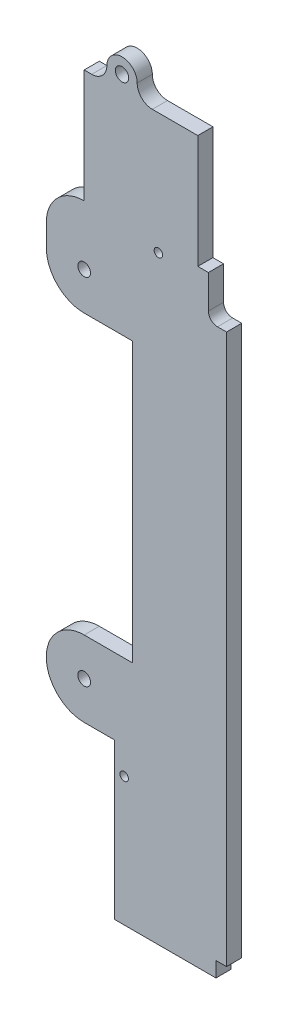
ISO-10303-21;
HEADER;
FILE_DESCRIPTION(('STEP AP214'),'2;1');
FILE_NAME('part.step','',(''),(''),'','','');
FILE_SCHEMA(('AUTOMOTIVE_DESIGN { 1 0 10303 214 1 1 1 1 }'));
ENDSEC;
DATA;
#1=APPLICATION_CONTEXT('core data for automotive mechanical design processes');
#2=APPLICATION_PROTOCOL_DEFINITION('international standard','automotive_design',2000,#1);
#3=PRODUCT_CONTEXT('',#1,'mechanical');
#4=PRODUCT('Part','Part','',(#3));
#5=PRODUCT_RELATED_PRODUCT_CATEGORY('part','',(#4));
#6=PRODUCT_DEFINITION_FORMATION('','',#4);
#7=PRODUCT_DEFINITION_CONTEXT('part definition',#1,'design');
#8=PRODUCT_DEFINITION('design','',#6,#7);
#9=PRODUCT_DEFINITION_SHAPE('','',#8);
#10=(LENGTH_UNIT() NAMED_UNIT(*) SI_UNIT(.MILLI.,.METRE.));
#11=(NAMED_UNIT(*) PLANE_ANGLE_UNIT() SI_UNIT($,.RADIAN.));
#12=(NAMED_UNIT(*) SI_UNIT($,.STERADIAN.) SOLID_ANGLE_UNIT());
#13=UNCERTAINTY_MEASURE_WITH_UNIT(LENGTH_MEASURE(1.E-05),#10,'distance_accuracy_value','');
#14=(GEOMETRIC_REPRESENTATION_CONTEXT(3) GLOBAL_UNCERTAINTY_ASSIGNED_CONTEXT((#13)) GLOBAL_UNIT_ASSIGNED_CONTEXT((#10,
#11,#12)) REPRESENTATION_CONTEXT('',''));
#15=CARTESIAN_POINT('',(0.,0.,0.));
#16=DIRECTION('',(0.,0.,1.));
#17=DIRECTION('',(1.,0.,0.));
#18=AXIS2_PLACEMENT_3D('',#15,#16,#17);
#19=CARTESIAN_POINT('',(44.,125.6,5.));
#20=DIRECTION('',(0.,0.,1.));
#21=DIRECTION('',(1.,0.,0.));
#22=AXIS2_PLACEMENT_3D('',#19,#20,#21);
#23=PLANE('',#22);
#24=CARTESIAN_POINT('',(24.5,134.,5.));
#25=DIRECTION('',(0.,0.,1.));
#26=DIRECTION('',(1.,0.,0.));
#27=AXIS2_PLACEMENT_3D('',#24,#25,#26);
#28=CIRCLE('',#27,1.40000000000001);
#29=CARTESIAN_POINT('',(25.9,134.,5.));
#30=VERTEX_POINT('',#29);
#31=EDGE_CURVE('E452',#30,#30,#28,.T.);
#32=ORIENTED_EDGE('',*,*,#31,.F.);
#33=EDGE_LOOP('',(#32));
#34=FACE_BOUND('',#33,.T.);
#35=CARTESIAN_POINT('',(13.2,-21.3,5.));
#36=DIRECTION('',(0.,0.,1.));
#37=DIRECTION('',(1.,0.,0.));
#38=AXIS2_PLACEMENT_3D('',#35,#36,#37);
#39=CIRCLE('',#38,1.4);
#40=CARTESIAN_POINT('',(14.6,-21.3,5.));
#41=VERTEX_POINT('',#40);
#42=EDGE_CURVE('E425',#41,#41,#39,.T.);
#43=ORIENTED_EDGE('',*,*,#42,.F.);
#44=EDGE_LOOP('',(#43));
#45=FACE_BOUND('',#44,.T.);
#46=CARTESIAN_POINT('',(0.,117.,5.));
#47=DIRECTION('',(0.,0.,1.));
#48=DIRECTION('',(1.,0.,0.));
#49=AXIS2_PLACEMENT_3D('',#46,#47,#48);
#50=CIRCLE('',#49,2.1);
#51=CARTESIAN_POINT('',(2.1,117.,5.));
#52=VERTEX_POINT('',#51);
#53=EDGE_CURVE('E438',#52,#52,#50,.T.);
#54=ORIENTED_EDGE('',*,*,#53,.F.);
#55=EDGE_LOOP('',(#54));
#56=FACE_BOUND('',#55,.T.);
#57=DIRECTION('',(1.,0.,0.));
#58=VECTOR('',#57,1.);
#59=CARTESIAN_POINT('',(43.5,-58.8,5.));
#60=LINE('',#59,#58);
#61=CARTESIAN_POINT('',(43.5,-58.8,5.));
#62=VERTEX_POINT('',#61);
#63=CARTESIAN_POINT('',(47.,-58.8,5.));
#64=VERTEX_POINT('',#63);
#65=EDGE_CURVE('E297',#62,#64,#60,.T.);
#66=ORIENTED_EDGE('',*,*,#65,.T.);
#67=DIRECTION('',(0.,1.,0.));
#68=VECTOR('',#67,1.);
#69=CARTESIAN_POINT('',(47.,-29.8,5.));
#70=LINE('',#69,#68);
#71=CARTESIAN_POINT('',(47.,122.6,5.));
#72=VERTEX_POINT('',#71);
#73=EDGE_CURVE('E154',#64,#72,#70,.T.);
#74=ORIENTED_EDGE('',*,*,#73,.T.);
#75=DIRECTION('',(-1.,0.,0.));
#76=VECTOR('',#75,1.);
#77=CARTESIAN_POINT('',(44.,122.6,5.));
#78=LINE('',#77,#76);
#79=CARTESIAN_POINT('',(44.,122.6,5.));
#80=VERTEX_POINT('',#79);
#81=EDGE_CURVE('E364',#72,#80,#78,.T.);
#82=ORIENTED_EDGE('',*,*,#81,.T.);
#83=CARTESIAN_POINT('',(44.,125.6,5.));
#84=DIRECTION('',(0.,0.,-1.));
#85=DIRECTION('',(1.,0.,0.));
#86=AXIS2_PLACEMENT_3D('',#83,#84,#85);
#87=CIRCLE('',#86,3.);
#88=CARTESIAN_POINT('',(41.,125.6,5.));
#89=VERTEX_POINT('',#88);
#90=EDGE_CURVE('E383',#80,#89,#87,.T.);
#91=ORIENTED_EDGE('',*,*,#90,.T.);
#92=DIRECTION('',(0.,1.,0.));
#93=VECTOR('',#92,1.);
#94=CARTESIAN_POINT('',(41.,136.6,5.));
#95=LINE('',#94,#93);
#96=CARTESIAN_POINT('',(41.,136.6,5.));
#97=VERTEX_POINT('',#96);
#98=EDGE_CURVE('E380',#89,#97,#95,.T.);
#99=ORIENTED_EDGE('',*,*,#98,.T.);
#100=DIRECTION('',(-1.,0.,0.));
#101=VECTOR('',#100,1.);
#102=CARTESIAN_POINT('',(41.,136.6,5.));
#103=LINE('',#102,#101);
#104=CARTESIAN_POINT('',(37.5,136.6,5.));
#105=VERTEX_POINT('',#104);
#106=EDGE_CURVE('E382',#97,#105,#103,.T.);
#107=ORIENTED_EDGE('',*,*,#106,.T.);
#108=DIRECTION('',(0.,1.,0.));
#109=VECTOR('',#108,1.);
#110=CARTESIAN_POINT('',(37.5,136.6,5.));
#111=LINE('',#110,#109);
#112=CARTESIAN_POINT('',(37.5,174.,5.));
#113=VERTEX_POINT('',#112);
#114=EDGE_CURVE('E385',#105,#113,#111,.T.);
#115=ORIENTED_EDGE('',*,*,#114,.T.);
#116=DIRECTION('',(-1.,0.,0.));
#117=VECTOR('',#116,1.);
#118=CARTESIAN_POINT('',(22.5,174.,5.));
#119=LINE('',#118,#117);
#120=CARTESIAN_POINT('',(22.5,174.,5.));
#121=VERTEX_POINT('',#120);
#122=EDGE_CURVE('E391',#113,#121,#119,.T.);
#123=ORIENTED_EDGE('',*,*,#122,.T.);
#124=CARTESIAN_POINT('',(22.5,179.,5.));
#125=DIRECTION('',(0.,0.,-1.));
#126=DIRECTION('',(1.,0.,0.));
#127=AXIS2_PLACEMENT_3D('',#124,#125,#126);
#128=CIRCLE('',#127,4.99999999999998);
#129=CARTESIAN_POINT('',(17.5,179.,5.));
#130=VERTEX_POINT('',#129);
#131=EDGE_CURVE('E393',#121,#130,#128,.T.);
#132=ORIENTED_EDGE('',*,*,#131,.T.);
#133=CARTESIAN_POINT('',(12.5,179.,5.));
#134=DIRECTION('',(0.,0.,1.));
#135=DIRECTION('',(1.,0.,0.));
#136=AXIS2_PLACEMENT_3D('',#133,#134,#135);
#137=CIRCLE('',#136,5.00000000000003);
#138=CARTESIAN_POINT('',(7.49999999999994,179.,5.));
#139=VERTEX_POINT('',#138);
#140=EDGE_CURVE('E395',#130,#139,#137,.T.);
#141=ORIENTED_EDGE('',*,*,#140,.T.);
#142=CARTESIAN_POINT('',(2.49999999999997,179.,5.));
#143=DIRECTION('',(0.,0.,-1.));
#144=DIRECTION('',(1.,0.,0.));
#145=AXIS2_PLACEMENT_3D('',#142,#143,#144);
#146=CIRCLE('',#145,4.99999999999999);
#147=CARTESIAN_POINT('',(2.49999999999997,174.,5.));
#148=VERTEX_POINT('',#147);
#149=EDGE_CURVE('E397',#139,#148,#146,.T.);
#150=ORIENTED_EDGE('',*,*,#149,.T.);
#151=DIRECTION('',(-1.,0.,0.));
#152=VECTOR('',#151,1.);
#153=CARTESIAN_POINT('',(0.,174.,5.));
#154=LINE('',#153,#152);
#155=CARTESIAN_POINT('',(0.,174.,5.));
#156=VERTEX_POINT('',#155);
#157=EDGE_CURVE('E399',#148,#156,#154,.T.);
#158=ORIENTED_EDGE('',*,*,#157,.T.);
#159=DIRECTION('',(0.,-1.,0.));
#160=VECTOR('',#159,1.);
#161=CARTESIAN_POINT('',(0.,136.6,5.));
#162=LINE('',#161,#160);
#163=CARTESIAN_POINT('',(0.,136.6,5.));
#164=VERTEX_POINT('',#163);
#165=EDGE_CURVE('E401',#156,#164,#162,.T.);
#166=ORIENTED_EDGE('',*,*,#165,.T.);
#167=CARTESIAN_POINT('',(0.,124.1,5.));
#168=DIRECTION('',(0.,0.,1.));
#169=DIRECTION('',(1.,0.,0.));
#170=AXIS2_PLACEMENT_3D('',#167,#168,#169);
#171=CIRCLE('',#170,12.5);
#172=CARTESIAN_POINT('',(-12.5,124.1,5.));
#173=VERTEX_POINT('',#172);
#174=EDGE_CURVE('E403',#164,#173,#171,.T.);
#175=ORIENTED_EDGE('',*,*,#174,.T.);
#176=DIRECTION('',(0.,-1.,0.));
#177=VECTOR('',#176,1.);
#178=CARTESIAN_POINT('',(-12.5,124.1,5.));
#179=LINE('',#178,#177);
#180=CARTESIAN_POINT('',(-12.5,117.,5.));
#181=VERTEX_POINT('',#180);
#182=EDGE_CURVE('E405',#173,#181,#179,.T.);
#183=ORIENTED_EDGE('',*,*,#182,.T.);
#184=CARTESIAN_POINT('',(0.,117.,5.));
#185=DIRECTION('',(0.,0.,1.));
#186=DIRECTION('',(1.,0.,0.));
#187=AXIS2_PLACEMENT_3D('',#184,#185,#186);
#188=CIRCLE('',#187,12.5);
#189=CARTESIAN_POINT('',(0.,104.5,5.));
#190=VERTEX_POINT('',#189);
#191=EDGE_CURVE('E407',#181,#190,#188,.T.);
#192=ORIENTED_EDGE('',*,*,#191,.T.);
#193=DIRECTION('',(1.,0.,0.));
#194=VECTOR('',#193,1.);
#195=CARTESIAN_POINT('',(16.,104.5,5.));
#196=LINE('',#195,#194);
#197=CARTESIAN_POINT('',(16.,104.5,5.));
#198=VERTEX_POINT('',#197);
#199=EDGE_CURVE('E409',#190,#198,#196,.T.);
#200=ORIENTED_EDGE('',*,*,#199,.T.);
#201=DIRECTION('',(0.,-1.,0.));
#202=VECTOR('',#201,1.);
#203=CARTESIAN_POINT('',(16.,12.5,5.));
#204=LINE('',#203,#202);
#205=CARTESIAN_POINT('',(16.,12.5,5.));
#206=VERTEX_POINT('',#205);
#207=EDGE_CURVE('E411',#198,#206,#204,.T.);
#208=ORIENTED_EDGE('',*,*,#207,.T.);
#209=DIRECTION('',(-1.,0.,0.));
#210=VECTOR('',#209,1.);
#211=CARTESIAN_POINT('',(0.,12.5,5.));
#212=LINE('',#211,#210);
#213=CARTESIAN_POINT('',(0.,12.5,5.));
#214=VERTEX_POINT('',#213);
#215=EDGE_CURVE('E414',#206,#214,#212,.T.);
#216=ORIENTED_EDGE('',*,*,#215,.T.);
#217=CARTESIAN_POINT('',(0.,0.,5.));
#218=DIRECTION('',(0.,0.,1.));
#219=DIRECTION('',(1.,0.,0.));
#220=AXIS2_PLACEMENT_3D('',#217,#218,#219);
#221=CIRCLE('',#220,12.5);
#222=CARTESIAN_POINT('',(0.,-12.5,5.));
#223=VERTEX_POINT('',#222);
#224=EDGE_CURVE('E417',#214,#223,#221,.T.);
#225=ORIENTED_EDGE('',*,*,#224,.T.);
#226=DIRECTION('',(1.,0.,0.));
#227=VECTOR('',#226,1.);
#228=CARTESIAN_POINT('',(0.,-12.5,5.));
#229=LINE('',#228,#227);
#230=CARTESIAN_POINT('',(10.,-12.5,5.));
#231=VERTEX_POINT('',#230);
#232=EDGE_CURVE('E225',#223,#231,#229,.T.);
#233=ORIENTED_EDGE('',*,*,#232,.T.);
#234=DIRECTION('',(0.,-1.,0.));
#235=VECTOR('',#234,1.);
#236=CARTESIAN_POINT('',(10.,-12.5,5.));
#237=LINE('',#236,#235);
#238=CARTESIAN_POINT('',(10.,-63.8,5.));
#239=VERTEX_POINT('',#238);
#240=EDGE_CURVE('E219',#231,#239,#237,.T.);
#241=ORIENTED_EDGE('',*,*,#240,.T.);
#242=DIRECTION('',(1.,0.,0.));
#243=VECTOR('',#242,1.);
#244=CARTESIAN_POINT('',(43.5,-63.8,5.));
#245=LINE('',#244,#243);
#246=CARTESIAN_POINT('',(43.5,-63.8,5.));
#247=VERTEX_POINT('',#246);
#248=EDGE_CURVE('E223',#239,#247,#245,.T.);
#249=ORIENTED_EDGE('',*,*,#248,.T.);
#250=DIRECTION('',(0.,1.,0.));
#251=VECTOR('',#250,1.);
#252=CARTESIAN_POINT('',(43.5,-58.8,5.));
#253=LINE('',#252,#251);
#254=EDGE_CURVE('E59',#247,#62,#253,.T.);
#255=ORIENTED_EDGE('',*,*,#254,.T.);
#256=EDGE_LOOP('',(#66,#74,#82,#91,#99,#107,#115,#123,#132,#141,#150,#158,#166,#175,#183,#192,
#200,#208,#216,#225,#233,#241,#249,#255));
#257=FACE_BOUND('',#256,.T.);
#258=CARTESIAN_POINT('',(0.,0.,5.));
#259=DIRECTION('',(0.,0.,1.));
#260=DIRECTION('',(1.,0.,0.));
#261=AXIS2_PLACEMENT_3D('',#258,#259,#260);
#262=CIRCLE('',#261,2.1);
#263=CARTESIAN_POINT('',(2.1,0.,5.));
#264=VERTEX_POINT('',#263);
#265=EDGE_CURVE('E247',#264,#264,#262,.T.);
#266=ORIENTED_EDGE('',*,*,#265,.F.);
#267=EDGE_LOOP('',(#266));
#268=FACE_BOUND('',#267,.T.);
#269=CARTESIAN_POINT('',(12.5,179.,5.));
#270=DIRECTION('',(0.,0.,1.));
#271=DIRECTION('',(1.,0.,0.));
#272=AXIS2_PLACEMENT_3D('',#269,#270,#271);
#273=CIRCLE('',#272,2.2);
#274=CARTESIAN_POINT('',(14.7,179.,5.));
#275=VERTEX_POINT('',#274);
#276=EDGE_CURVE('E445',#275,#275,#273,.T.);
#277=ORIENTED_EDGE('',*,*,#276,.F.);
#278=EDGE_LOOP('',(#277));
#279=FACE_BOUND('',#278,.T.);
#280=ADVANCED_FACE('F42',(#34,#45,#56,#257,#268,#279),#23,.T.);
#281=CARTESIAN_POINT('',(44.,125.6,0.));
#282=DIRECTION('',(0.,0.,1.));
#283=DIRECTION('',(1.,0.,0.));
#284=AXIS2_PLACEMENT_3D('',#281,#282,#283);
#285=PLANE('',#284);
#286=CARTESIAN_POINT('',(24.5,134.,0.));
#287=DIRECTION('',(0.,0.,1.));
#288=DIRECTION('',(1.,0.,0.));
#289=AXIS2_PLACEMENT_3D('',#286,#287,#288);
#290=CIRCLE('',#289,1.40000000000001);
#291=CARTESIAN_POINT('',(25.9,134.,0.));
#292=VERTEX_POINT('',#291);
#293=EDGE_CURVE('E429',#292,#292,#290,.T.);
#294=ORIENTED_EDGE('',*,*,#293,.T.);
#295=EDGE_LOOP('',(#294));
#296=FACE_BOUND('',#295,.T.);
#297=CARTESIAN_POINT('',(13.2,-21.3,0.));
#298=DIRECTION('',(0.,0.,1.));
#299=DIRECTION('',(1.,0.,0.));
#300=AXIS2_PLACEMENT_3D('',#297,#298,#299);
#301=CIRCLE('',#300,1.4);
#302=CARTESIAN_POINT('',(14.6,-21.3,0.));
#303=VERTEX_POINT('',#302);
#304=EDGE_CURVE('E421',#303,#303,#301,.T.);
#305=ORIENTED_EDGE('',*,*,#304,.T.);
#306=EDGE_LOOP('',(#305));
#307=FACE_BOUND('',#306,.T.);
#308=CARTESIAN_POINT('',(0.,117.,0.));
#309=DIRECTION('',(0.,0.,1.));
#310=DIRECTION('',(1.,0.,0.));
#311=AXIS2_PLACEMENT_3D('',#308,#309,#310);
#312=CIRCLE('',#311,2.1);
#313=CARTESIAN_POINT('',(2.1,117.,0.));
#314=VERTEX_POINT('',#313);
#315=EDGE_CURVE('E442',#314,#314,#312,.T.);
#316=ORIENTED_EDGE('',*,*,#315,.T.);
#317=EDGE_LOOP('',(#316));
#318=FACE_BOUND('',#317,.T.);
#319=DIRECTION('',(1.,0.,0.));
#320=VECTOR('',#319,1.);
#321=CARTESIAN_POINT('',(43.5,-58.8,0.));
#322=LINE('',#321,#320);
#323=CARTESIAN_POINT('',(43.5,-58.8,0.));
#324=VERTEX_POINT('',#323);
#325=CARTESIAN_POINT('',(47.,-58.8,0.));
#326=VERTEX_POINT('',#325);
#327=EDGE_CURVE('E243',#324,#326,#322,.T.);
#328=ORIENTED_EDGE('',*,*,#327,.F.);
#329=DIRECTION('',(0.,1.,0.));
#330=VECTOR('',#329,1.);
#331=CARTESIAN_POINT('',(43.5,-58.8,0.));
#332=LINE('',#331,#330);
#333=CARTESIAN_POINT('',(43.5,-63.8,0.));
#334=VERTEX_POINT('',#333);
#335=EDGE_CURVE('E146',#334,#324,#332,.T.);
#336=ORIENTED_EDGE('',*,*,#335,.F.);
#337=DIRECTION('',(1.,0.,0.));
#338=VECTOR('',#337,1.);
#339=CARTESIAN_POINT('',(43.5,-63.8,0.));
#340=LINE('',#339,#338);
#341=CARTESIAN_POINT('',(10.,-63.8,0.));
#342=VERTEX_POINT('',#341);
#343=EDGE_CURVE('E140',#342,#334,#340,.T.);
#344=ORIENTED_EDGE('',*,*,#343,.F.);
#345=DIRECTION('',(0.,-1.,0.));
#346=VECTOR('',#345,1.);
#347=CARTESIAN_POINT('',(10.,-63.8,0.));
#348=LINE('',#347,#346);
#349=CARTESIAN_POINT('',(10.,-12.5,0.));
#350=VERTEX_POINT('',#349);
#351=EDGE_CURVE('E233',#350,#342,#348,.T.);
#352=ORIENTED_EDGE('',*,*,#351,.F.);
#353=DIRECTION('',(1.,0.,0.));
#354=VECTOR('',#353,1.);
#355=CARTESIAN_POINT('',(0.,-12.5,0.));
#356=LINE('',#355,#354);
#357=CARTESIAN_POINT('',(0.,-12.5,0.));
#358=VERTEX_POINT('',#357);
#359=EDGE_CURVE('E289',#358,#350,#356,.T.);
#360=ORIENTED_EDGE('',*,*,#359,.F.);
#361=CARTESIAN_POINT('',(0.,0.,0.));
#362=DIRECTION('',(0.,0.,1.));
#363=DIRECTION('',(1.,0.,0.));
#364=AXIS2_PLACEMENT_3D('',#361,#362,#363);
#365=CIRCLE('',#364,12.5);
#366=CARTESIAN_POINT('',(0.,12.5,0.));
#367=VERTEX_POINT('',#366);
#368=EDGE_CURVE('E286',#367,#358,#365,.T.);
#369=ORIENTED_EDGE('',*,*,#368,.F.);
#370=DIRECTION('',(-1.,0.,0.));
#371=VECTOR('',#370,1.);
#372=CARTESIAN_POINT('',(0.,12.5,0.));
#373=LINE('',#372,#371);
#374=CARTESIAN_POINT('',(16.,12.5,0.));
#375=VERTEX_POINT('',#374);
#376=EDGE_CURVE('E283',#375,#367,#373,.T.);
#377=ORIENTED_EDGE('',*,*,#376,.F.);
#378=DIRECTION('',(0.,-1.,0.));
#379=VECTOR('',#378,1.);
#380=CARTESIAN_POINT('',(16.,12.5,0.));
#381=LINE('',#380,#379);
#382=CARTESIAN_POINT('',(16.,104.5,0.));
#383=VERTEX_POINT('',#382);
#384=EDGE_CURVE('E280',#383,#375,#381,.T.);
#385=ORIENTED_EDGE('',*,*,#384,.F.);
#386=DIRECTION('',(1.,0.,0.));
#387=VECTOR('',#386,1.);
#388=CARTESIAN_POINT('',(16.,104.5,0.));
#389=LINE('',#388,#387);
#390=CARTESIAN_POINT('',(0.,104.5,0.));
#391=VERTEX_POINT('',#390);
#392=EDGE_CURVE('E278',#391,#383,#389,.T.);
#393=ORIENTED_EDGE('',*,*,#392,.F.);
#394=CARTESIAN_POINT('',(0.,117.,0.));
#395=DIRECTION('',(0.,0.,1.));
#396=DIRECTION('',(1.,0.,0.));
#397=AXIS2_PLACEMENT_3D('',#394,#395,#396);
#398=CIRCLE('',#397,12.5);
#399=CARTESIAN_POINT('',(-12.5,117.,0.));
#400=VERTEX_POINT('',#399);
#401=EDGE_CURVE('E276',#400,#391,#398,.T.);
#402=ORIENTED_EDGE('',*,*,#401,.F.);
#403=DIRECTION('',(0.,-1.,0.));
#404=VECTOR('',#403,1.);
#405=CARTESIAN_POINT('',(-12.5,124.1,0.));
#406=LINE('',#405,#404);
#407=CARTESIAN_POINT('',(-12.5,124.1,0.));
#408=VERTEX_POINT('',#407);
#409=EDGE_CURVE('E274',#408,#400,#406,.T.);
#410=ORIENTED_EDGE('',*,*,#409,.F.);
#411=CARTESIAN_POINT('',(0.,124.1,0.));
#412=DIRECTION('',(0.,0.,1.));
#413=DIRECTION('',(1.,0.,0.));
#414=AXIS2_PLACEMENT_3D('',#411,#412,#413);
#415=CIRCLE('',#414,12.5);
#416=CARTESIAN_POINT('',(0.,136.6,0.));
#417=VERTEX_POINT('',#416);
#418=EDGE_CURVE('E272',#417,#408,#415,.T.);
#419=ORIENTED_EDGE('',*,*,#418,.F.);
#420=DIRECTION('',(0.,-1.,0.));
#421=VECTOR('',#420,1.);
#422=CARTESIAN_POINT('',(0.,136.6,0.));
#423=LINE('',#422,#421);
#424=CARTESIAN_POINT('',(0.,174.,0.));
#425=VERTEX_POINT('',#424);
#426=EDGE_CURVE('E270',#425,#417,#423,.T.);
#427=ORIENTED_EDGE('',*,*,#426,.F.);
#428=DIRECTION('',(-1.,0.,0.));
#429=VECTOR('',#428,1.);
#430=CARTESIAN_POINT('',(0.,174.,0.));
#431=LINE('',#430,#429);
#432=CARTESIAN_POINT('',(2.49999999999997,174.,0.));
#433=VERTEX_POINT('',#432);
#434=EDGE_CURVE('E268',#433,#425,#431,.T.);
#435=ORIENTED_EDGE('',*,*,#434,.F.);
#436=CARTESIAN_POINT('',(2.49999999999997,179.,0.));
#437=DIRECTION('',(0.,0.,-1.));
#438=DIRECTION('',(1.,0.,0.));
#439=AXIS2_PLACEMENT_3D('',#436,#437,#438);
#440=CIRCLE('',#439,4.99999999999999);
#441=CARTESIAN_POINT('',(7.49999999999994,179.,0.));
#442=VERTEX_POINT('',#441);
#443=EDGE_CURVE('E266',#442,#433,#440,.T.);
#444=ORIENTED_EDGE('',*,*,#443,.F.);
#445=CARTESIAN_POINT('',(12.5,179.,0.));
#446=DIRECTION('',(0.,0.,1.));
#447=DIRECTION('',(1.,0.,0.));
#448=AXIS2_PLACEMENT_3D('',#445,#446,#447);
#449=CIRCLE('',#448,5.00000000000003);
#450=CARTESIAN_POINT('',(17.5,179.,0.));
#451=VERTEX_POINT('',#450);
#452=EDGE_CURVE('E264',#451,#442,#449,.T.);
#453=ORIENTED_EDGE('',*,*,#452,.F.);
#454=CARTESIAN_POINT('',(22.5,179.,0.));
#455=DIRECTION('',(0.,0.,-1.));
#456=DIRECTION('',(1.,0.,0.));
#457=AXIS2_PLACEMENT_3D('',#454,#455,#456);
#458=CIRCLE('',#457,4.99999999999998);
#459=CARTESIAN_POINT('',(22.5,174.,0.));
#460=VERTEX_POINT('',#459);
#461=EDGE_CURVE('E262',#460,#451,#458,.T.);
#462=ORIENTED_EDGE('',*,*,#461,.F.);
#463=DIRECTION('',(-1.,0.,0.));
#464=VECTOR('',#463,1.);
#465=CARTESIAN_POINT('',(22.5,174.,0.));
#466=LINE('',#465,#464);
#467=CARTESIAN_POINT('',(37.5,174.,0.));
#468=VERTEX_POINT('',#467);
#469=EDGE_CURVE('E260',#468,#460,#466,.T.);
#470=ORIENTED_EDGE('',*,*,#469,.F.);
#471=DIRECTION('',(0.,1.,0.));
#472=VECTOR('',#471,1.);
#473=CARTESIAN_POINT('',(37.5,136.6,0.));
#474=LINE('',#473,#472);
#475=CARTESIAN_POINT('',(37.5,136.6,0.));
#476=VERTEX_POINT('',#475);
#477=EDGE_CURVE('E258',#476,#468,#474,.T.);
#478=ORIENTED_EDGE('',*,*,#477,.F.);
#479=DIRECTION('',(-1.,0.,0.));
#480=VECTOR('',#479,1.);
#481=CARTESIAN_POINT('',(41.,136.6,0.));
#482=LINE('',#481,#480);
#483=CARTESIAN_POINT('',(41.,136.6,0.));
#484=VERTEX_POINT('',#483);
#485=EDGE_CURVE('E256',#484,#476,#482,.T.);
#486=ORIENTED_EDGE('',*,*,#485,.F.);
#487=DIRECTION('',(0.,1.,0.));
#488=VECTOR('',#487,1.);
#489=CARTESIAN_POINT('',(41.,136.6,0.));
#490=LINE('',#489,#488);
#491=CARTESIAN_POINT('',(41.,125.6,0.));
#492=VERTEX_POINT('',#491);
#493=EDGE_CURVE('E254',#492,#484,#490,.T.);
#494=ORIENTED_EDGE('',*,*,#493,.F.);
#495=CARTESIAN_POINT('',(44.,125.6,0.));
#496=DIRECTION('',(0.,0.,-1.));
#497=DIRECTION('',(1.,0.,0.));
#498=AXIS2_PLACEMENT_3D('',#495,#496,#497);
#499=CIRCLE('',#498,3.);
#500=CARTESIAN_POINT('',(44.,122.6,0.));
#501=VERTEX_POINT('',#500);
#502=EDGE_CURVE('E252',#501,#492,#499,.T.);
#503=ORIENTED_EDGE('',*,*,#502,.F.);
#504=DIRECTION('',(-1.,0.,0.));
#505=VECTOR('',#504,1.);
#506=CARTESIAN_POINT('',(44.,122.6,0.));
#507=LINE('',#506,#505);
#508=CARTESIAN_POINT('',(47.,122.6,0.));
#509=VERTEX_POINT('',#508);
#510=EDGE_CURVE('E250',#509,#501,#507,.T.);
#511=ORIENTED_EDGE('',*,*,#510,.F.);
#512=DIRECTION('',(0.,1.,0.));
#513=VECTOR('',#512,1.);
#514=CARTESIAN_POINT('',(47.,122.6,0.));
#515=LINE('',#514,#513);
#516=EDGE_CURVE('E246',#326,#509,#515,.T.);
#517=ORIENTED_EDGE('',*,*,#516,.F.);
#518=EDGE_LOOP('',(#328,#336,#344,#352,#360,#369,#377,#385,#393,#402,#410,#419,#427,#435,#444,
#453,#462,#470,#478,#486,#494,#503,#511,#517));
#519=FACE_BOUND('',#518,.T.);
#520=CARTESIAN_POINT('',(0.,0.,0.));
#521=DIRECTION('',(0.,0.,1.));
#522=DIRECTION('',(1.,0.,0.));
#523=AXIS2_PLACEMENT_3D('',#520,#521,#522);
#524=CIRCLE('',#523,2.1);
#525=CARTESIAN_POINT('',(2.1,0.,0.));
#526=VERTEX_POINT('',#525);
#527=EDGE_CURVE('E434',#526,#526,#524,.T.);
#528=ORIENTED_EDGE('',*,*,#527,.T.);
#529=EDGE_LOOP('',(#528));
#530=FACE_BOUND('',#529,.T.);
#531=CARTESIAN_POINT('',(12.5,179.,0.));
#532=DIRECTION('',(0.,0.,1.));
#533=DIRECTION('',(1.,0.,0.));
#534=AXIS2_PLACEMENT_3D('',#531,#532,#533);
#535=CIRCLE('',#534,2.2);
#536=CARTESIAN_POINT('',(14.7,179.,0.));
#537=VERTEX_POINT('',#536);
#538=EDGE_CURVE('E424',#537,#537,#535,.T.);
#539=ORIENTED_EDGE('',*,*,#538,.T.);
#540=EDGE_LOOP('',(#539));
#541=FACE_BOUND('',#540,.T.);
#542=ADVANCED_FACE('F368',(#296,#307,#318,#519,#530,#541),#285,.F.);
#543=CARTESIAN_POINT('',(43.5,-58.8,5.));
#544=DIRECTION('',(0.,1.,0.));
#545=DIRECTION('',(0.,0.,1.));
#546=AXIS2_PLACEMENT_3D('',#543,#544,#545);
#547=PLANE('',#546);
#548=ORIENTED_EDGE('',*,*,#327,.T.);
#549=DIRECTION('',(0.,0.,-1.));
#550=VECTOR('',#549,1.);
#551=CARTESIAN_POINT('',(47.,-58.8,5.));
#552=LINE('',#551,#550);
#553=EDGE_CURVE('E11',#64,#326,#552,.T.);
#554=ORIENTED_EDGE('',*,*,#553,.F.);
#555=ORIENTED_EDGE('',*,*,#65,.F.);
#556=DIRECTION('',(0.,0.,-1.));
#557=VECTOR('',#556,1.);
#558=CARTESIAN_POINT('',(43.5,-58.8,5.));
#559=LINE('',#558,#557);
#560=EDGE_CURVE('E239',#62,#324,#559,.T.);
#561=ORIENTED_EDGE('',*,*,#560,.T.);
#562=EDGE_LOOP('',(#548,#554,#555,#561));
#563=FACE_BOUND('',#562,.T.);
#564=ADVANCED_FACE('F44',(#563),#547,.F.);
#565=CARTESIAN_POINT('',(47.,122.6,5.));
#566=DIRECTION('',(-1.,0.,0.));
#567=DIRECTION('',(0.,-1.,0.));
#568=AXIS2_PLACEMENT_3D('',#565,#566,#567);
#569=PLANE('',#568);
#570=ORIENTED_EDGE('',*,*,#516,.T.);
#571=DIRECTION('',(0.,0.,-1.));
#572=VECTOR('',#571,1.);
#573=CARTESIAN_POINT('',(47.,122.6,5.));
#574=LINE('',#573,#572);
#575=EDGE_CURVE('E51',#72,#509,#574,.T.);
#576=ORIENTED_EDGE('',*,*,#575,.F.);
#577=ORIENTED_EDGE('',*,*,#73,.F.);
#578=ORIENTED_EDGE('',*,*,#553,.T.);
#579=EDGE_LOOP('',(#570,#576,#577,#578));
#580=FACE_BOUND('',#579,.T.);
#581=ADVANCED_FACE('F487',(#580),#569,.F.);
#582=CARTESIAN_POINT('',(44.,122.6,5.));
#583=DIRECTION('',(0.,-1.,0.));
#584=DIRECTION('',(1.,0.,0.));
#585=AXIS2_PLACEMENT_3D('',#582,#583,#584);
#586=PLANE('',#585);
#587=ORIENTED_EDGE('',*,*,#510,.T.);
#588=DIRECTION('',(0.,0.,-1.));
#589=VECTOR('',#588,1.);
#590=CARTESIAN_POINT('',(44.,122.6,5.));
#591=LINE('',#590,#589);
#592=EDGE_CURVE('E356',#80,#501,#591,.T.);
#593=ORIENTED_EDGE('',*,*,#592,.F.);
#594=ORIENTED_EDGE('',*,*,#81,.F.);
#595=ORIENTED_EDGE('',*,*,#575,.T.);
#596=EDGE_LOOP('',(#587,#593,#594,#595));
#597=FACE_BOUND('',#596,.T.);
#598=ADVANCED_FACE('F362',(#597),#586,.F.);
#599=CARTESIAN_POINT('',(44.,125.6,5.));
#600=DIRECTION('',(0.,0.,-1.));
#601=DIRECTION('',(-1.,0.,0.));
#602=AXIS2_PLACEMENT_3D('',#599,#600,#601);
#603=CYLINDRICAL_SURFACE('',#602,3.);
#604=ORIENTED_EDGE('',*,*,#502,.T.);
#605=DIRECTION('',(0.,0.,-1.));
#606=VECTOR('',#605,1.);
#607=CARTESIAN_POINT('',(41.,125.6,5.));
#608=LINE('',#607,#606);
#609=EDGE_CURVE('E353',#89,#492,#608,.T.);
#610=ORIENTED_EDGE('',*,*,#609,.F.);
#611=ORIENTED_EDGE('',*,*,#90,.F.);
#612=ORIENTED_EDGE('',*,*,#592,.T.);
#613=EDGE_LOOP('',(#604,#610,#611,#612));
#614=FACE_BOUND('',#613,.T.);
#615=ADVANCED_FACE('F374',(#614),#603,.F.);
#616=CARTESIAN_POINT('',(41.,136.6,5.));
#617=DIRECTION('',(-1.,0.,0.));
#618=DIRECTION('',(0.,0.,1.));
#619=AXIS2_PLACEMENT_3D('',#616,#617,#618);
#620=PLANE('',#619);
#621=ORIENTED_EDGE('',*,*,#493,.T.);
#622=DIRECTION('',(0.,0.,-1.));
#623=VECTOR('',#622,1.);
#624=CARTESIAN_POINT('',(41.,136.6,5.));
#625=LINE('',#624,#623);
#626=EDGE_CURVE('E350',#97,#484,#625,.T.);
#627=ORIENTED_EDGE('',*,*,#626,.F.);
#628=ORIENTED_EDGE('',*,*,#98,.F.);
#629=ORIENTED_EDGE('',*,*,#609,.T.);
#630=EDGE_LOOP('',(#621,#627,#628,#629));
#631=FACE_BOUND('',#630,.T.);
#632=ADVANCED_FACE('F378',(#631),#620,.F.);
#633=CARTESIAN_POINT('',(41.,136.6,5.));
#634=DIRECTION('',(0.,-1.,0.));
#635=DIRECTION('',(1.,0.,0.));
#636=AXIS2_PLACEMENT_3D('',#633,#634,#635);
#637=PLANE('',#636);
#638=ORIENTED_EDGE('',*,*,#485,.T.);
#639=DIRECTION('',(0.,0.,-1.));
#640=VECTOR('',#639,1.);
#641=CARTESIAN_POINT('',(37.5,136.6,5.));
#642=LINE('',#641,#640);
#643=EDGE_CURVE('E347',#105,#476,#642,.T.);
#644=ORIENTED_EDGE('',*,*,#643,.F.);
#645=ORIENTED_EDGE('',*,*,#106,.F.);
#646=ORIENTED_EDGE('',*,*,#626,.T.);
#647=EDGE_LOOP('',(#638,#644,#645,#646));
#648=FACE_BOUND('',#647,.T.);
#649=ADVANCED_FACE('F557',(#648),#637,.F.);
#650=CARTESIAN_POINT('',(37.5,136.6,5.));
#651=DIRECTION('',(-1.,0.,0.));
#652=DIRECTION('',(0.,0.,1.));
#653=AXIS2_PLACEMENT_3D('',#650,#651,#652);
#654=PLANE('',#653);
#655=ORIENTED_EDGE('',*,*,#477,.T.);
#656=DIRECTION('',(0.,0.,-1.));
#657=VECTOR('',#656,1.);
#658=CARTESIAN_POINT('',(37.5,174.,5.));
#659=LINE('',#658,#657);
#660=EDGE_CURVE('E344',#113,#468,#659,.T.);
#661=ORIENTED_EDGE('',*,*,#660,.F.);
#662=ORIENTED_EDGE('',*,*,#114,.F.);
#663=ORIENTED_EDGE('',*,*,#643,.T.);
#664=EDGE_LOOP('',(#655,#661,#662,#663));
#665=FACE_BOUND('',#664,.T.);
#666=ADVANCED_FACE('F553',(#665),#654,.F.);
#667=CARTESIAN_POINT('',(22.5,174.,5.));
#668=DIRECTION('',(0.,-1.,0.));
#669=DIRECTION('',(0.,0.,-1.));
#670=AXIS2_PLACEMENT_3D('',#667,#668,#669);
#671=PLANE('',#670);
#672=ORIENTED_EDGE('',*,*,#469,.T.);
#673=DIRECTION('',(0.,0.,-1.));
#674=VECTOR('',#673,1.);
#675=CARTESIAN_POINT('',(22.5,174.,5.));
#676=LINE('',#675,#674);
#677=EDGE_CURVE('E341',#121,#460,#676,.T.);
#678=ORIENTED_EDGE('',*,*,#677,.F.);
#679=ORIENTED_EDGE('',*,*,#122,.F.);
#680=ORIENTED_EDGE('',*,*,#660,.T.);
#681=EDGE_LOOP('',(#672,#678,#679,#680));
#682=FACE_BOUND('',#681,.T.);
#683=ADVANCED_FACE('F549',(#682),#671,.F.);
#684=CARTESIAN_POINT('',(22.5,179.,5.));
#685=DIRECTION('',(0.,0.,-1.));
#686=DIRECTION('',(-1.,0.,0.));
#687=AXIS2_PLACEMENT_3D('',#684,#685,#686);
#688=CYLINDRICAL_SURFACE('',#687,4.99999999999998);
#689=ORIENTED_EDGE('',*,*,#461,.T.);
#690=DIRECTION('',(0.,0.,-1.));
#691=VECTOR('',#690,1.);
#692=CARTESIAN_POINT('',(17.5,179.,5.));
#693=LINE('',#692,#691);
#694=EDGE_CURVE('E338',#130,#451,#693,.T.);
#695=ORIENTED_EDGE('',*,*,#694,.F.);
#696=ORIENTED_EDGE('',*,*,#131,.F.);
#697=ORIENTED_EDGE('',*,*,#677,.T.);
#698=EDGE_LOOP('',(#689,#695,#696,#697));
#699=FACE_BOUND('',#698,.T.);
#700=ADVANCED_FACE('F545',(#699),#688,.F.);
#701=CARTESIAN_POINT('',(12.5,179.,5.));
#702=DIRECTION('',(0.,0.,-1.));
#703=DIRECTION('',(-1.,0.,0.));
#704=AXIS2_PLACEMENT_3D('',#701,#702,#703);
#705=CYLINDRICAL_SURFACE('',#704,5.00000000000003);
#706=ORIENTED_EDGE('',*,*,#452,.T.);
#707=DIRECTION('',(0.,0.,-1.));
#708=VECTOR('',#707,1.);
#709=CARTESIAN_POINT('',(7.49999999999994,179.,5.));
#710=LINE('',#709,#708);
#711=EDGE_CURVE('E335',#139,#442,#710,.T.);
#712=ORIENTED_EDGE('',*,*,#711,.F.);
#713=ORIENTED_EDGE('',*,*,#140,.F.);
#714=ORIENTED_EDGE('',*,*,#694,.T.);
#715=EDGE_LOOP('',(#706,#712,#713,#714));
#716=FACE_BOUND('',#715,.T.);
#717=ADVANCED_FACE('F541',(#716),#705,.T.);
#718=CARTESIAN_POINT('',(2.49999999999997,179.,5.));
#719=DIRECTION('',(0.,0.,-1.));
#720=DIRECTION('',(-1.,0.,0.));
#721=AXIS2_PLACEMENT_3D('',#718,#719,#720);
#722=CYLINDRICAL_SURFACE('',#721,4.99999999999999);
#723=ORIENTED_EDGE('',*,*,#443,.T.);
#724=DIRECTION('',(0.,0.,-1.));
#725=VECTOR('',#724,1.);
#726=CARTESIAN_POINT('',(2.49999999999997,174.,5.));
#727=LINE('',#726,#725);
#728=EDGE_CURVE('E332',#148,#433,#727,.T.);
#729=ORIENTED_EDGE('',*,*,#728,.F.);
#730=ORIENTED_EDGE('',*,*,#149,.F.);
#731=ORIENTED_EDGE('',*,*,#711,.T.);
#732=EDGE_LOOP('',(#723,#729,#730,#731));
#733=FACE_BOUND('',#732,.T.);
#734=ADVANCED_FACE('F537',(#733),#722,.F.);
#735=CARTESIAN_POINT('',(0.,174.,5.));
#736=DIRECTION('',(0.,-1.,0.));
#737=DIRECTION('',(0.,0.,-1.));
#738=AXIS2_PLACEMENT_3D('',#735,#736,#737);
#739=PLANE('',#738);
#740=ORIENTED_EDGE('',*,*,#434,.T.);
#741=DIRECTION('',(0.,0.,-1.));
#742=VECTOR('',#741,1.);
#743=CARTESIAN_POINT('',(0.,174.,5.));
#744=LINE('',#743,#742);
#745=EDGE_CURVE('E329',#156,#425,#744,.T.);
#746=ORIENTED_EDGE('',*,*,#745,.F.);
#747=ORIENTED_EDGE('',*,*,#157,.F.);
#748=ORIENTED_EDGE('',*,*,#728,.T.);
#749=EDGE_LOOP('',(#740,#746,#747,#748));
#750=FACE_BOUND('',#749,.T.);
#751=ADVANCED_FACE('F533',(#750),#739,.F.);
#752=CARTESIAN_POINT('',(0.,136.6,5.));
#753=DIRECTION('',(1.,0.,0.));
#754=DIRECTION('',(0.,0.,-1.));
#755=AXIS2_PLACEMENT_3D('',#752,#753,#754);
#756=PLANE('',#755);
#757=ORIENTED_EDGE('',*,*,#426,.T.);
#758=DIRECTION('',(0.,0.,-1.));
#759=VECTOR('',#758,1.);
#760=CARTESIAN_POINT('',(0.,136.6,5.));
#761=LINE('',#760,#759);
#762=EDGE_CURVE('E326',#164,#417,#761,.T.);
#763=ORIENTED_EDGE('',*,*,#762,.F.);
#764=ORIENTED_EDGE('',*,*,#165,.F.);
#765=ORIENTED_EDGE('',*,*,#745,.T.);
#766=EDGE_LOOP('',(#757,#763,#764,#765));
#767=FACE_BOUND('',#766,.T.);
#768=ADVANCED_FACE('F529',(#767),#756,.F.);
#769=CARTESIAN_POINT('',(0.,124.1,5.));
#770=DIRECTION('',(0.,0.,-1.));
#771=DIRECTION('',(-1.,0.,0.));
#772=AXIS2_PLACEMENT_3D('',#769,#770,#771);
#773=CYLINDRICAL_SURFACE('',#772,12.5);
#774=ORIENTED_EDGE('',*,*,#418,.T.);
#775=DIRECTION('',(0.,0.,-1.));
#776=VECTOR('',#775,1.);
#777=CARTESIAN_POINT('',(-12.5,124.1,5.));
#778=LINE('',#777,#776);
#779=EDGE_CURVE('E323',#173,#408,#778,.T.);
#780=ORIENTED_EDGE('',*,*,#779,.F.);
#781=ORIENTED_EDGE('',*,*,#174,.F.);
#782=ORIENTED_EDGE('',*,*,#762,.T.);
#783=EDGE_LOOP('',(#774,#780,#781,#782));
#784=FACE_BOUND('',#783,.T.);
#785=ADVANCED_FACE('F525',(#784),#773,.T.);
#786=CARTESIAN_POINT('',(-12.5,124.1,5.));
#787=DIRECTION('',(1.,0.,0.));
#788=DIRECTION('',(0.,1.,0.));
#789=AXIS2_PLACEMENT_3D('',#786,#787,#788);
#790=PLANE('',#789);
#791=ORIENTED_EDGE('',*,*,#409,.T.);
#792=DIRECTION('',(0.,0.,-1.));
#793=VECTOR('',#792,1.);
#794=CARTESIAN_POINT('',(-12.5,117.,5.));
#795=LINE('',#794,#793);
#796=EDGE_CURVE('E320',#181,#400,#795,.T.);
#797=ORIENTED_EDGE('',*,*,#796,.F.);
#798=ORIENTED_EDGE('',*,*,#182,.F.);
#799=ORIENTED_EDGE('',*,*,#779,.T.);
#800=EDGE_LOOP('',(#791,#797,#798,#799));
#801=FACE_BOUND('',#800,.T.);
#802=ADVANCED_FACE('F521',(#801),#790,.F.);
#803=CARTESIAN_POINT('',(0.,117.,5.));
#804=DIRECTION('',(0.,0.,-1.));
#805=DIRECTION('',(-1.,0.,0.));
#806=AXIS2_PLACEMENT_3D('',#803,#804,#805);
#807=CYLINDRICAL_SURFACE('',#806,12.5);
#808=ORIENTED_EDGE('',*,*,#401,.T.);
#809=DIRECTION('',(0.,0.,-1.));
#810=VECTOR('',#809,1.);
#811=CARTESIAN_POINT('',(0.,104.5,5.));
#812=LINE('',#811,#810);
#813=EDGE_CURVE('E317',#190,#391,#812,.T.);
#814=ORIENTED_EDGE('',*,*,#813,.F.);
#815=ORIENTED_EDGE('',*,*,#191,.F.);
#816=ORIENTED_EDGE('',*,*,#796,.T.);
#817=EDGE_LOOP('',(#808,#814,#815,#816));
#818=FACE_BOUND('',#817,.T.);
#819=ADVANCED_FACE('F517',(#818),#807,.T.);
#820=CARTESIAN_POINT('',(16.,104.5,5.));
#821=DIRECTION('',(0.,1.,0.));
#822=DIRECTION('',(-1.,0.,0.));
#823=AXIS2_PLACEMENT_3D('',#820,#821,#822);
#824=PLANE('',#823);
#825=ORIENTED_EDGE('',*,*,#392,.T.);
#826=DIRECTION('',(0.,0.,-1.));
#827=VECTOR('',#826,1.);
#828=CARTESIAN_POINT('',(16.,104.5,5.));
#829=LINE('',#828,#827);
#830=EDGE_CURVE('E314',#198,#383,#829,.T.);
#831=ORIENTED_EDGE('',*,*,#830,.F.);
#832=ORIENTED_EDGE('',*,*,#199,.F.);
#833=ORIENTED_EDGE('',*,*,#813,.T.);
#834=EDGE_LOOP('',(#825,#831,#832,#833));
#835=FACE_BOUND('',#834,.T.);
#836=ADVANCED_FACE('F513',(#835),#824,.F.);
#837=CARTESIAN_POINT('',(16.,12.5,5.));
#838=DIRECTION('',(1.,0.,0.));
#839=DIRECTION('',(0.,0.,-1.));
#840=AXIS2_PLACEMENT_3D('',#837,#838,#839);
#841=PLANE('',#840);
#842=ORIENTED_EDGE('',*,*,#384,.T.);
#843=DIRECTION('',(0.,0.,-1.));
#844=VECTOR('',#843,1.);
#845=CARTESIAN_POINT('',(16.,12.5,5.));
#846=LINE('',#845,#844);
#847=EDGE_CURVE('E310',#206,#375,#846,.T.);
#848=ORIENTED_EDGE('',*,*,#847,.F.);
#849=ORIENTED_EDGE('',*,*,#207,.F.);
#850=ORIENTED_EDGE('',*,*,#830,.T.);
#851=EDGE_LOOP('',(#842,#848,#849,#850));
#852=FACE_BOUND('',#851,.T.);
#853=ADVANCED_FACE('F509',(#852),#841,.F.);
#854=CARTESIAN_POINT('',(0.,12.5,5.));
#855=DIRECTION('',(0.,-1.,0.));
#856=DIRECTION('',(1.,0.,0.));
#857=AXIS2_PLACEMENT_3D('',#854,#855,#856);
#858=PLANE('',#857);
#859=ORIENTED_EDGE('',*,*,#376,.T.);
#860=DIRECTION('',(0.,0.,-1.));
#861=VECTOR('',#860,1.);
#862=CARTESIAN_POINT('',(0.,12.5,5.));
#863=LINE('',#862,#861);
#864=EDGE_CURVE('E306',#214,#367,#863,.T.);
#865=ORIENTED_EDGE('',*,*,#864,.F.);
#866=ORIENTED_EDGE('',*,*,#215,.F.);
#867=ORIENTED_EDGE('',*,*,#847,.T.);
#868=EDGE_LOOP('',(#859,#865,#866,#867));
#869=FACE_BOUND('',#868,.T.);
#870=ADVANCED_FACE('F505',(#869),#858,.F.);
#871=CARTESIAN_POINT('',(0.,0.,5.));
#872=DIRECTION('',(0.,0.,-1.));
#873=DIRECTION('',(-1.,0.,0.));
#874=AXIS2_PLACEMENT_3D('',#871,#872,#873);
#875=CYLINDRICAL_SURFACE('',#874,12.5);
#876=ORIENTED_EDGE('',*,*,#368,.T.);
#877=DIRECTION('',(0.,0.,-1.));
#878=VECTOR('',#877,1.);
#879=CARTESIAN_POINT('',(0.,-12.5,5.));
#880=LINE('',#879,#878);
#881=EDGE_CURVE('E302',#223,#358,#880,.T.);
#882=ORIENTED_EDGE('',*,*,#881,.F.);
#883=ORIENTED_EDGE('',*,*,#224,.F.);
#884=ORIENTED_EDGE('',*,*,#864,.T.);
#885=EDGE_LOOP('',(#876,#882,#883,#884));
#886=FACE_BOUND('',#885,.T.);
#887=ADVANCED_FACE('F501',(#886),#875,.T.);
#888=CARTESIAN_POINT('',(0.,-12.5,5.));
#889=DIRECTION('',(0.,1.,0.));
#890=DIRECTION('',(-1.,0.,0.));
#891=AXIS2_PLACEMENT_3D('',#888,#889,#890);
#892=PLANE('',#891);
#893=ORIENTED_EDGE('',*,*,#359,.T.);
#894=DIRECTION('',(0.,0.,-1.));
#895=VECTOR('',#894,1.);
#896=CARTESIAN_POINT('',(10.,-12.5,5.));
#897=LINE('',#896,#895);
#898=EDGE_CURVE('E234',#231,#350,#897,.T.);
#899=ORIENTED_EDGE('',*,*,#898,.F.);
#900=ORIENTED_EDGE('',*,*,#232,.F.);
#901=ORIENTED_EDGE('',*,*,#881,.T.);
#902=EDGE_LOOP('',(#893,#899,#900,#901));
#903=FACE_BOUND('',#902,.T.);
#904=ADVANCED_FACE('F498',(#903),#892,.F.);
#905=CARTESIAN_POINT('',(10.,-63.8,5.));
#906=DIRECTION('',(1.,0.,0.));
#907=DIRECTION('',(0.,1.,0.));
#908=AXIS2_PLACEMENT_3D('',#905,#906,#907);
#909=PLANE('',#908);
#910=ORIENTED_EDGE('',*,*,#351,.T.);
#911=DIRECTION('',(0.,0.,-1.));
#912=VECTOR('',#911,1.);
#913=CARTESIAN_POINT('',(10.,-63.8,5.));
#914=LINE('',#913,#912);
#915=EDGE_CURVE('E231',#239,#342,#914,.T.);
#916=ORIENTED_EDGE('',*,*,#915,.F.);
#917=ORIENTED_EDGE('',*,*,#240,.F.);
#918=ORIENTED_EDGE('',*,*,#898,.T.);
#919=EDGE_LOOP('',(#910,#916,#917,#918));
#920=FACE_BOUND('',#919,.T.);
#921=ADVANCED_FACE('F232',(#920),#909,.F.);
#922=CARTESIAN_POINT('',(43.5,-63.8,5.));
#923=DIRECTION('',(0.,1.,0.));
#924=DIRECTION('',(0.,0.,1.));
#925=AXIS2_PLACEMENT_3D('',#922,#923,#924);
#926=PLANE('',#925);
#927=ORIENTED_EDGE('',*,*,#343,.T.);
#928=DIRECTION('',(0.,0.,-1.));
#929=VECTOR('',#928,1.);
#930=CARTESIAN_POINT('',(43.5,-63.8,5.));
#931=LINE('',#930,#929);
#932=EDGE_CURVE('E235',#247,#334,#931,.T.);
#933=ORIENTED_EDGE('',*,*,#932,.F.);
#934=ORIENTED_EDGE('',*,*,#248,.F.);
#935=ORIENTED_EDGE('',*,*,#915,.T.);
#936=EDGE_LOOP('',(#927,#933,#934,#935));
#937=FACE_BOUND('',#936,.T.);
#938=ADVANCED_FACE('F237',(#937),#926,.F.);
#939=CARTESIAN_POINT('',(43.5,-58.8,5.));
#940=DIRECTION('',(-1.,0.,0.));
#941=DIRECTION('',(0.,0.,1.));
#942=AXIS2_PLACEMENT_3D('',#939,#940,#941);
#943=PLANE('',#942);
#944=ORIENTED_EDGE('',*,*,#335,.T.);
#945=ORIENTED_EDGE('',*,*,#560,.F.);
#946=ORIENTED_EDGE('',*,*,#254,.F.);
#947=ORIENTED_EDGE('',*,*,#932,.T.);
#948=EDGE_LOOP('',(#944,#945,#946,#947));
#949=FACE_BOUND('',#948,.T.);
#950=ADVANCED_FACE('F491',(#949),#943,.F.);
#951=CARTESIAN_POINT('',(0.,0.,5.));
#952=DIRECTION('',(0.,0.,-1.));
#953=DIRECTION('',(-1.,0.,0.));
#954=AXIS2_PLACEMENT_3D('',#951,#952,#953);
#955=CYLINDRICAL_SURFACE('',#954,2.1);
#956=ORIENTED_EDGE('',*,*,#265,.T.);
#957=EDGE_LOOP('',(#956));
#958=FACE_BOUND('',#957,.T.);
#959=ORIENTED_EDGE('',*,*,#527,.F.);
#960=EDGE_LOOP('',(#959));
#961=FACE_BOUND('',#960,.T.);
#962=ADVANCED_FACE('F478',(#958,#961),#955,.F.);
#963=CARTESIAN_POINT('',(0.,117.,5.));
#964=DIRECTION('',(0.,0.,-1.));
#965=DIRECTION('',(-1.,0.,0.));
#966=AXIS2_PLACEMENT_3D('',#963,#964,#965);
#967=CYLINDRICAL_SURFACE('',#966,2.1);
#968=ORIENTED_EDGE('',*,*,#53,.T.);
#969=EDGE_LOOP('',(#968));
#970=FACE_BOUND('',#969,.T.);
#971=ORIENTED_EDGE('',*,*,#315,.F.);
#972=EDGE_LOOP('',(#971));
#973=FACE_BOUND('',#972,.T.);
#974=ADVANCED_FACE('F474',(#970,#973),#967,.F.);
#975=CARTESIAN_POINT('',(12.5,179.,5.));
#976=DIRECTION('',(0.,0.,-1.));
#977=DIRECTION('',(-1.,0.,0.));
#978=AXIS2_PLACEMENT_3D('',#975,#976,#977);
#979=CYLINDRICAL_SURFACE('',#978,2.2);
#980=ORIENTED_EDGE('',*,*,#276,.T.);
#981=EDGE_LOOP('',(#980));
#982=FACE_BOUND('',#981,.T.);
#983=ORIENTED_EDGE('',*,*,#538,.F.);
#984=EDGE_LOOP('',(#983));
#985=FACE_BOUND('',#984,.T.);
#986=ADVANCED_FACE('F477',(#982,#985),#979,.F.);
#987=CARTESIAN_POINT('',(13.2,-21.3,0.));
#988=DIRECTION('',(0.,0.,1.));
#989=DIRECTION('',(1.,0.,0.));
#990=AXIS2_PLACEMENT_3D('',#987,#988,#989);
#991=CYLINDRICAL_SURFACE('',#990,1.4);
#992=ORIENTED_EDGE('',*,*,#304,.F.);
#993=EDGE_LOOP('',(#992));
#994=FACE_BOUND('',#993,.T.);
#995=ORIENTED_EDGE('',*,*,#42,.T.);
#996=EDGE_LOOP('',(#995));
#997=FACE_BOUND('',#996,.T.);
#998=ADVANCED_FACE('F463',(#994,#997),#991,.F.);
#999=CARTESIAN_POINT('',(24.5,134.,0.));
#1000=DIRECTION('',(0.,0.,1.));
#1001=DIRECTION('',(1.,0.,0.));
#1002=AXIS2_PLACEMENT_3D('',#999,#1000,#1001);
#1003=CYLINDRICAL_SURFACE('',#1002,1.40000000000001);
#1004=ORIENTED_EDGE('',*,*,#293,.F.);
#1005=EDGE_LOOP('',(#1004));
#1006=FACE_BOUND('',#1005,.T.);
#1007=ORIENTED_EDGE('',*,*,#31,.T.);
#1008=EDGE_LOOP('',(#1007));
#1009=FACE_BOUND('',#1008,.T.);
#1010=ADVANCED_FACE('F460',(#1006,#1009),#1003,.F.);
#1011=CLOSED_SHELL('',(#280,#542,#564,#581,#598,#615,#632,#649,#666,#683,#700,#717,#734,#751,
#768,#785,#802,#819,#836,#853,#870,#887,#904,#921,#938,#950,#962,#974,#986,#998,#1010));
#1012=MANIFOLD_SOLID_BREP('B2',#1011);
#1013=ADVANCED_BREP_SHAPE_REPRESENTATION('',(#18,#1012),#14);
#1014=SHAPE_DEFINITION_REPRESENTATION(#9,#1013);
ENDSEC;
END-ISO-10303-21;
